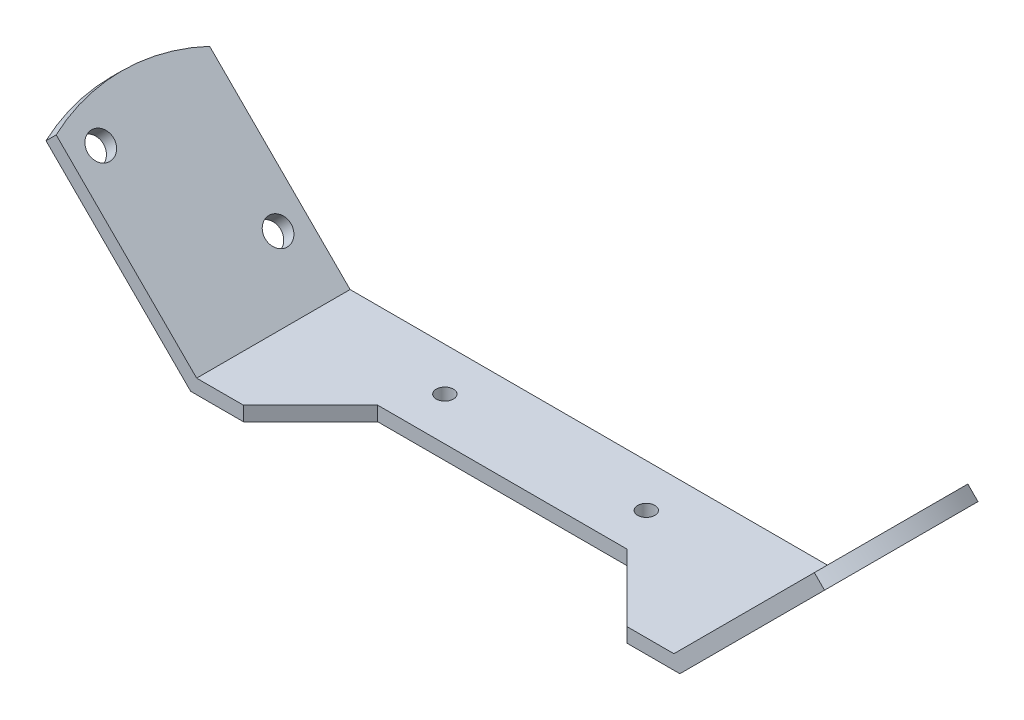
ISO-10303-21;
HEADER;
FILE_DESCRIPTION(('STEP AP214'),'2;1');
FILE_NAME('part.step','',(''),(''),'','','');
FILE_SCHEMA(('AUTOMOTIVE_DESIGN { 1 0 10303 214 1 1 1 1 }'));
ENDSEC;
DATA;
#1=APPLICATION_CONTEXT('core data for automotive mechanical design processes');
#2=APPLICATION_PROTOCOL_DEFINITION('international standard','automotive_design',2000,#1);
#3=PRODUCT_CONTEXT('',#1,'mechanical');
#4=PRODUCT('Part','Part','',(#3));
#5=PRODUCT_RELATED_PRODUCT_CATEGORY('part','',(#4));
#6=PRODUCT_DEFINITION_FORMATION('','',#4);
#7=PRODUCT_DEFINITION_CONTEXT('part definition',#1,'design');
#8=PRODUCT_DEFINITION('design','',#6,#7);
#9=PRODUCT_DEFINITION_SHAPE('','',#8);
#10=(LENGTH_UNIT() NAMED_UNIT(*) SI_UNIT(.MILLI.,.METRE.));
#11=(NAMED_UNIT(*) PLANE_ANGLE_UNIT() SI_UNIT($,.RADIAN.));
#12=(NAMED_UNIT(*) SI_UNIT($,.STERADIAN.) SOLID_ANGLE_UNIT());
#13=UNCERTAINTY_MEASURE_WITH_UNIT(LENGTH_MEASURE(1.E-05),#10,'distance_accuracy_value','');
#14=(GEOMETRIC_REPRESENTATION_CONTEXT(3) GLOBAL_UNCERTAINTY_ASSIGNED_CONTEXT((#13)) GLOBAL_UNIT_ASSIGNED_CONTEXT((#10,
#11,#12)) REPRESENTATION_CONTEXT('',''));
#15=CARTESIAN_POINT('',(0.,0.,0.));
#16=DIRECTION('',(0.,0.,1.));
#17=DIRECTION('',(1.,0.,0.));
#18=AXIS2_PLACEMENT_3D('',#15,#16,#17);
#19=CARTESIAN_POINT('',(0.,1.5,0.));
#20=DIRECTION('',(0.,1.,0.));
#21=DIRECTION('',(0.,0.,1.));
#22=AXIS2_PLACEMENT_3D('',#19,#20,#21);
#23=PLANE('',#22);
#24=CARTESIAN_POINT('',(-10.5,1.5,0.));
#25=DIRECTION('',(0.,1.,0.));
#26=DIRECTION('',(0.,0.,1.));
#27=AXIS2_PLACEMENT_3D('',#24,#25,#26);
#28=CIRCLE('',#27,0.9);
#29=CARTESIAN_POINT('',(-10.5,1.5,0.899999999999995));
#30=VERTEX_POINT('',#29);
#31=EDGE_CURVE('E274',#30,#30,#28,.T.);
#32=ORIENTED_EDGE('',*,*,#31,.F.);
#33=EDGE_LOOP('',(#32));
#34=FACE_BOUND('',#33,.T.);
#35=CARTESIAN_POINT('',(10.5,1.5,0.));
#36=DIRECTION('',(0.,1.,0.));
#37=DIRECTION('',(0.,0.,1.));
#38=AXIS2_PLACEMENT_3D('',#35,#36,#37);
#39=CIRCLE('',#38,0.9);
#40=CARTESIAN_POINT('',(10.5,1.5,0.899999999999995));
#41=VERTEX_POINT('',#40);
#42=EDGE_CURVE('E268',#41,#41,#39,.T.);
#43=ORIENTED_EDGE('',*,*,#42,.F.);
#44=EDGE_LOOP('',(#43));
#45=FACE_BOUND('',#44,.T.);
#46=DIRECTION('',(-1.,0.,0.));
#47=VECTOR('',#46,1.);
#48=CARTESIAN_POINT('',(0.,1.5,-4.5));
#49=LINE('',#48,#47);
#50=CARTESIAN_POINT('',(24.8786796564404,1.5,-4.5));
#51=VERTEX_POINT('',#50);
#52=CARTESIAN_POINT('',(-24.8786796564404,1.5,-4.5));
#53=VERTEX_POINT('',#52);
#54=EDGE_CURVE('E187',#51,#53,#49,.T.);
#55=ORIENTED_EDGE('',*,*,#54,.T.);
#56=DIRECTION('',(0.,0.,1.));
#57=VECTOR('',#56,1.);
#58=CARTESIAN_POINT('',(-24.8786796564404,1.5,0.));
#59=LINE('',#58,#57);
#60=CARTESIAN_POINT('',(-24.8786796564404,1.5,11.5));
#61=VERTEX_POINT('',#60);
#62=EDGE_CURVE('E150',#53,#61,#59,.T.);
#63=ORIENTED_EDGE('',*,*,#62,.T.);
#64=DIRECTION('',(-1.,0.,0.));
#65=VECTOR('',#64,1.);
#66=CARTESIAN_POINT('',(0.,1.5,11.5));
#67=LINE('',#66,#65);
#68=CARTESIAN_POINT('',(-19.9999999999999,1.5,11.5));
#69=VERTEX_POINT('',#68);
#70=EDGE_CURVE('E130',#69,#61,#67,.T.);
#71=ORIENTED_EDGE('',*,*,#70,.F.);
#72=DIRECTION('',(-0.707106781186544,0.,0.707106781186551));
#73=VECTOR('',#72,1.);
#74=CARTESIAN_POINT('',(-4.25000000000007,1.5,-4.25000000000002));
#75=LINE('',#74,#73);
#76=CARTESIAN_POINT('',(-13.,1.5,4.50000000000001));
#77=VERTEX_POINT('',#76);
#78=EDGE_CURVE('E178',#77,#69,#75,.T.);
#79=ORIENTED_EDGE('',*,*,#78,.F.);
#80=DIRECTION('',(1.,0.,0.));
#81=VECTOR('',#80,1.);
#82=CARTESIAN_POINT('',(0.,1.5,4.5));
#83=LINE('',#82,#81);
#84=CARTESIAN_POINT('',(13.,1.5,4.5));
#85=VERTEX_POINT('',#84);
#86=EDGE_CURVE('E182',#77,#85,#83,.T.);
#87=ORIENTED_EDGE('',*,*,#86,.T.);
#88=DIRECTION('',(0.707106781186544,0.,0.707106781186551));
#89=VECTOR('',#88,1.);
#90=CARTESIAN_POINT('',(4.25000000000006,1.5,-4.25000000000002));
#91=LINE('',#90,#89);
#92=CARTESIAN_POINT('',(19.9999999999999,1.5,11.5));
#93=VERTEX_POINT('',#92);
#94=EDGE_CURVE('E184',#85,#93,#91,.T.);
#95=ORIENTED_EDGE('',*,*,#94,.T.);
#96=DIRECTION('',(1.,0.,0.));
#97=VECTOR('',#96,1.);
#98=CARTESIAN_POINT('',(0.,1.5,11.5));
#99=LINE('',#98,#97);
#100=CARTESIAN_POINT('',(24.8786796564404,1.5,11.5));
#101=VERTEX_POINT('',#100);
#102=EDGE_CURVE('E57',#93,#101,#99,.T.);
#103=ORIENTED_EDGE('',*,*,#102,.T.);
#104=DIRECTION('',(0.,0.,-1.));
#105=VECTOR('',#104,1.);
#106=CARTESIAN_POINT('',(24.8786796564404,1.5,0.));
#107=LINE('',#106,#105);
#108=EDGE_CURVE('E11',#101,#51,#107,.T.);
#109=ORIENTED_EDGE('',*,*,#108,.T.);
#110=EDGE_LOOP('',(#55,#63,#71,#79,#87,#95,#103,#109));
#111=FACE_BOUND('',#110,.T.);
#112=ADVANCED_FACE('F38',(#34,#45,#111),#23,.T.);
#113=CARTESIAN_POINT('',(0.,1.5,11.5));
#114=DIRECTION('',(0.,0.,1.));
#115=DIRECTION('',(1.,0.,0.));
#116=AXIS2_PLACEMENT_3D('',#113,#114,#115);
#117=PLANE('',#116);
#118=ORIENTED_EDGE('',*,*,#70,.T.);
#119=DIRECTION('',(-0.707106781186551,0.707106781186544,0.));
#120=VECTOR('',#119,1.);
#121=CARTESIAN_POINT('',(-11.68933982822,-11.6893398282202,11.5));
#122=LINE('',#121,#120);
#123=CARTESIAN_POINT('',(-39.5221415685956,16.1434619121551,11.5));
#124=VERTEX_POINT('',#123);
#125=EDGE_CURVE('E124',#61,#124,#122,.T.);
#126=ORIENTED_EDGE('',*,*,#125,.T.);
#127=DIRECTION('',(-0.707106781186544,-0.707106781186551,0.));
#128=VECTOR('',#127,1.);
#129=CARTESIAN_POINT('',(-39.5221415685956,16.1434619121551,11.5));
#130=LINE('',#129,#128);
#131=CARTESIAN_POINT('',(-40.5828017403755,15.0828017403753,11.5));
#132=VERTEX_POINT('',#131);
#133=EDGE_CURVE('E127',#124,#132,#130,.T.);
#134=ORIENTED_EDGE('',*,*,#133,.T.);
#135=DIRECTION('',(-0.707106781186551,0.707106781186544,0.));
#136=VECTOR('',#135,1.);
#137=CARTESIAN_POINT('',(-12.7499999999999,-12.75,11.5));
#138=LINE('',#137,#136);
#139=CARTESIAN_POINT('',(-25.5,0.,11.5));
#140=VERTEX_POINT('',#139);
#141=EDGE_CURVE('E221',#140,#132,#138,.T.);
#142=ORIENTED_EDGE('',*,*,#141,.F.);
#143=DIRECTION('',(-1.,0.,0.));
#144=VECTOR('',#143,1.);
#145=CARTESIAN_POINT('',(0.,0.,11.5));
#146=LINE('',#145,#144);
#147=CARTESIAN_POINT('',(-19.9999999999999,0.,11.5));
#148=VERTEX_POINT('',#147);
#149=EDGE_CURVE('E192',#148,#140,#146,.T.);
#150=ORIENTED_EDGE('',*,*,#149,.F.);
#151=DIRECTION('',(0.,-1.,0.));
#152=VECTOR('',#151,1.);
#153=CARTESIAN_POINT('',(-19.9999999999999,1.5,11.5));
#154=LINE('',#153,#152);
#155=EDGE_CURVE('E47',#69,#148,#154,.T.);
#156=ORIENTED_EDGE('',*,*,#155,.F.);
#157=EDGE_LOOP('',(#118,#126,#134,#142,#150,#156));
#158=FACE_BOUND('',#157,.T.);
#159=ADVANCED_FACE('F40',(#158),#117,.T.);
#160=CARTESIAN_POINT('',(-4.25000000000007,1.5,-4.25000000000002));
#161=DIRECTION('',(0.707106781186551,0.,0.707106781186544));
#162=DIRECTION('',(0.707106781186544,0.,-0.707106781186551));
#163=AXIS2_PLACEMENT_3D('',#160,#161,#162);
#164=PLANE('',#163);
#165=DIRECTION('',(-0.707106781186544,0.,0.707106781186551));
#166=VECTOR('',#165,1.);
#167=CARTESIAN_POINT('',(-4.25000000000007,0.,-4.25000000000002));
#168=LINE('',#167,#166);
#169=CARTESIAN_POINT('',(-13.,0.,4.50000000000001));
#170=VERTEX_POINT('',#169);
#171=EDGE_CURVE('E195',#170,#148,#168,.T.);
#172=ORIENTED_EDGE('',*,*,#171,.F.);
#173=DIRECTION('',(0.,-1.,0.));
#174=VECTOR('',#173,1.);
#175=CARTESIAN_POINT('',(-13.,1.5,4.50000000000001));
#176=LINE('',#175,#174);
#177=EDGE_CURVE('E214',#77,#170,#176,.T.);
#178=ORIENTED_EDGE('',*,*,#177,.F.);
#179=ORIENTED_EDGE('',*,*,#78,.T.);
#180=ORIENTED_EDGE('',*,*,#155,.T.);
#181=EDGE_LOOP('',(#172,#178,#179,#180));
#182=FACE_BOUND('',#181,.T.);
#183=ADVANCED_FACE('F219',(#182),#164,.T.);
#184=CARTESIAN_POINT('',(0.,1.5,4.5));
#185=DIRECTION('',(0.,0.,-1.));
#186=DIRECTION('',(-1.,0.,0.));
#187=AXIS2_PLACEMENT_3D('',#184,#185,#186);
#188=PLANE('',#187);
#189=DIRECTION('',(1.,0.,0.));
#190=VECTOR('',#189,1.);
#191=CARTESIAN_POINT('',(0.,0.,4.5));
#192=LINE('',#191,#190);
#193=CARTESIAN_POINT('',(13.,0.,4.5));
#194=VERTEX_POINT('',#193);
#195=EDGE_CURVE('E198',#170,#194,#192,.T.);
#196=ORIENTED_EDGE('',*,*,#195,.T.);
#197=DIRECTION('',(0.,-1.,0.));
#198=VECTOR('',#197,1.);
#199=CARTESIAN_POINT('',(13.,1.5,4.5));
#200=LINE('',#199,#198);
#201=EDGE_CURVE('E211',#85,#194,#200,.T.);
#202=ORIENTED_EDGE('',*,*,#201,.F.);
#203=ORIENTED_EDGE('',*,*,#86,.F.);
#204=ORIENTED_EDGE('',*,*,#177,.T.);
#205=EDGE_LOOP('',(#196,#202,#203,#204));
#206=FACE_BOUND('',#205,.T.);
#207=ADVANCED_FACE('F230',(#206),#188,.F.);
#208=CARTESIAN_POINT('',(4.25000000000006,1.5,-4.25000000000002));
#209=DIRECTION('',(0.707106781186551,0.,-0.707106781186544));
#210=DIRECTION('',(-0.707106781186544,0.,-0.707106781186551));
#211=AXIS2_PLACEMENT_3D('',#208,#209,#210);
#212=PLANE('',#211);
#213=DIRECTION('',(0.707106781186544,0.,0.707106781186551));
#214=VECTOR('',#213,1.);
#215=CARTESIAN_POINT('',(4.25000000000006,0.,-4.25000000000002));
#216=LINE('',#215,#214);
#217=CARTESIAN_POINT('',(19.9999999999999,0.,11.5));
#218=VERTEX_POINT('',#217);
#219=EDGE_CURVE('E200',#194,#218,#216,.T.);
#220=ORIENTED_EDGE('',*,*,#219,.T.);
#221=DIRECTION('',(0.,-1.,0.));
#222=VECTOR('',#221,1.);
#223=CARTESIAN_POINT('',(19.9999999999999,1.5,11.5));
#224=LINE('',#223,#222);
#225=EDGE_CURVE('E189',#93,#218,#224,.T.);
#226=ORIENTED_EDGE('',*,*,#225,.F.);
#227=ORIENTED_EDGE('',*,*,#94,.F.);
#228=ORIENTED_EDGE('',*,*,#201,.T.);
#229=EDGE_LOOP('',(#220,#226,#227,#228));
#230=FACE_BOUND('',#229,.T.);
#231=ADVANCED_FACE('F234',(#230),#212,.F.);
#232=CARTESIAN_POINT('',(0.,1.5,11.5));
#233=DIRECTION('',(0.,0.,-1.));
#234=DIRECTION('',(-1.,0.,0.));
#235=AXIS2_PLACEMENT_3D('',#232,#233,#234);
#236=PLANE('',#235);
#237=DIRECTION('',(1.,0.,0.));
#238=VECTOR('',#237,1.);
#239=CARTESIAN_POINT('',(0.,0.,11.5));
#240=LINE('',#239,#238);
#241=CARTESIAN_POINT('',(25.5,0.,11.5));
#242=VERTEX_POINT('',#241);
#243=EDGE_CURVE('E202',#218,#242,#240,.T.);
#244=ORIENTED_EDGE('',*,*,#243,.T.);
#245=DIRECTION('',(0.707106781186551,0.707106781186544,0.));
#246=VECTOR('',#245,1.);
#247=CARTESIAN_POINT('',(12.7499999999999,-12.75,11.5));
#248=LINE('',#247,#246);
#249=CARTESIAN_POINT('',(40.5828017403754,15.0828017403753,11.5));
#250=VERTEX_POINT('',#249);
#251=EDGE_CURVE('E168',#242,#250,#248,.T.);
#252=ORIENTED_EDGE('',*,*,#251,.T.);
#253=DIRECTION('',(0.707106781186544,-0.707106781186551,0.));
#254=VECTOR('',#253,1.);
#255=CARTESIAN_POINT('',(39.5221415685956,16.1434619121551,11.5));
#256=LINE('',#255,#254);
#257=CARTESIAN_POINT('',(39.5221415685956,16.1434619121551,11.5));
#258=VERTEX_POINT('',#257);
#259=EDGE_CURVE('E165',#258,#250,#256,.T.);
#260=ORIENTED_EDGE('',*,*,#259,.F.);
#261=DIRECTION('',(0.707106781186551,0.707106781186544,0.));
#262=VECTOR('',#261,1.);
#263=CARTESIAN_POINT('',(11.6893398282201,-11.6893398282202,11.5));
#264=LINE('',#263,#262);
#265=EDGE_CURVE('E160',#101,#258,#264,.T.);
#266=ORIENTED_EDGE('',*,*,#265,.F.);
#267=ORIENTED_EDGE('',*,*,#102,.F.);
#268=ORIENTED_EDGE('',*,*,#225,.T.);
#269=EDGE_LOOP('',(#244,#252,#260,#266,#267,#268));
#270=FACE_BOUND('',#269,.T.);
#271=ADVANCED_FACE('F337',(#270),#236,.F.);
#272=CARTESIAN_POINT('',(0.,1.5,-4.5));
#273=DIRECTION('',(0.,0.,1.));
#274=DIRECTION('',(1.,0.,0.));
#275=AXIS2_PLACEMENT_3D('',#272,#273,#274);
#276=PLANE('',#275);
#277=DIRECTION('',(-0.707106781186551,0.707106781186544,0.));
#278=VECTOR('',#277,1.);
#279=CARTESIAN_POINT('',(-11.68933982822,-11.6893398282202,-4.5));
#280=LINE('',#279,#278);
#281=CARTESIAN_POINT('',(-39.5221415685956,16.1434619121551,-4.50000000000001));
#282=VERTEX_POINT('',#281);
#283=EDGE_CURVE('E139',#53,#282,#280,.T.);
#284=ORIENTED_EDGE('',*,*,#283,.F.);
#285=ORIENTED_EDGE('',*,*,#54,.F.);
#286=DIRECTION('',(0.707106781186551,0.707106781186544,0.));
#287=VECTOR('',#286,1.);
#288=CARTESIAN_POINT('',(11.68933982822,-11.6893398282202,-4.50000000000001));
#289=LINE('',#288,#287);
#290=CARTESIAN_POINT('',(39.5221415685956,16.1434619121551,-4.5));
#291=VERTEX_POINT('',#290);
#292=EDGE_CURVE('E163',#51,#291,#289,.T.);
#293=ORIENTED_EDGE('',*,*,#292,.T.);
#294=DIRECTION('',(0.707106781186544,-0.707106781186551,0.));
#295=VECTOR('',#294,1.);
#296=CARTESIAN_POINT('',(39.5221415685956,16.1434619121551,-4.5));
#297=LINE('',#296,#295);
#298=CARTESIAN_POINT('',(40.5828017403754,15.0828017403753,-4.5));
#299=VERTEX_POINT('',#298);
#300=EDGE_CURVE('E173',#291,#299,#297,.T.);
#301=ORIENTED_EDGE('',*,*,#300,.T.);
#302=DIRECTION('',(0.707106781186551,0.707106781186544,0.));
#303=VECTOR('',#302,1.);
#304=CARTESIAN_POINT('',(12.7499999999999,-12.75,-4.50000000000001));
#305=LINE('',#304,#303);
#306=CARTESIAN_POINT('',(25.5,0.,-4.50000000000001));
#307=VERTEX_POINT('',#306);
#308=EDGE_CURVE('E161',#307,#299,#305,.T.);
#309=ORIENTED_EDGE('',*,*,#308,.F.);
#310=DIRECTION('',(-1.,0.,0.));
#311=VECTOR('',#310,1.);
#312=CARTESIAN_POINT('',(0.,0.,-4.5));
#313=LINE('',#312,#311);
#314=CARTESIAN_POINT('',(-25.5,0.,-4.5));
#315=VERTEX_POINT('',#314);
#316=EDGE_CURVE('E179',#307,#315,#313,.T.);
#317=ORIENTED_EDGE('',*,*,#316,.T.);
#318=DIRECTION('',(-0.707106781186551,0.707106781186544,0.));
#319=VECTOR('',#318,1.);
#320=CARTESIAN_POINT('',(-12.7499999999999,-12.75,-4.5));
#321=LINE('',#320,#319);
#322=CARTESIAN_POINT('',(-40.5828017403754,15.0828017403753,-4.50000000000001));
#323=VERTEX_POINT('',#322);
#324=EDGE_CURVE('E134',#315,#323,#321,.T.);
#325=ORIENTED_EDGE('',*,*,#324,.T.);
#326=DIRECTION('',(-0.707106781186544,-0.707106781186551,0.));
#327=VECTOR('',#326,1.);
#328=CARTESIAN_POINT('',(-39.5221415685956,16.1434619121551,-4.50000000000001));
#329=LINE('',#328,#327);
#330=EDGE_CURVE('E148',#282,#323,#329,.T.);
#331=ORIENTED_EDGE('',*,*,#330,.F.);
#332=EDGE_LOOP('',(#284,#285,#293,#301,#309,#317,#325,#331));
#333=FACE_BOUND('',#332,.T.);
#334=ADVANCED_FACE('F237',(#333),#276,.F.);
#335=CARTESIAN_POINT('',(0.,0.,0.));
#336=DIRECTION('',(0.,1.,0.));
#337=DIRECTION('',(0.,0.,1.));
#338=AXIS2_PLACEMENT_3D('',#335,#336,#337);
#339=PLANE('',#338);
#340=CARTESIAN_POINT('',(-10.5,0.,0.));
#341=DIRECTION('',(0.,1.,0.));
#342=DIRECTION('',(0.,0.,1.));
#343=AXIS2_PLACEMENT_3D('',#340,#341,#342);
#344=CIRCLE('',#343,0.9);
#345=CARTESIAN_POINT('',(-10.5,0.,0.899999999999995));
#346=VERTEX_POINT('',#345);
#347=EDGE_CURVE('E271',#346,#346,#344,.T.);
#348=ORIENTED_EDGE('',*,*,#347,.T.);
#349=EDGE_LOOP('',(#348));
#350=FACE_BOUND('',#349,.T.);
#351=CARTESIAN_POINT('',(10.5,0.,0.));
#352=DIRECTION('',(0.,1.,0.));
#353=DIRECTION('',(0.,0.,1.));
#354=AXIS2_PLACEMENT_3D('',#351,#352,#353);
#355=CIRCLE('',#354,0.9);
#356=CARTESIAN_POINT('',(10.5,0.,0.899999999999995));
#357=VERTEX_POINT('',#356);
#358=EDGE_CURVE('E265',#357,#357,#355,.T.);
#359=ORIENTED_EDGE('',*,*,#358,.T.);
#360=EDGE_LOOP('',(#359));
#361=FACE_BOUND('',#360,.T.);
#362=DIRECTION('',(0.,0.,-1.));
#363=VECTOR('',#362,1.);
#364=CARTESIAN_POINT('',(-25.5,0.,0.));
#365=LINE('',#364,#363);
#366=EDGE_CURVE('E175',#140,#315,#365,.T.);
#367=ORIENTED_EDGE('',*,*,#366,.T.);
#368=ORIENTED_EDGE('',*,*,#316,.F.);
#369=DIRECTION('',(0.,0.,-1.));
#370=VECTOR('',#369,1.);
#371=CARTESIAN_POINT('',(25.5,0.,0.));
#372=LINE('',#371,#370);
#373=EDGE_CURVE('E204',#242,#307,#372,.T.);
#374=ORIENTED_EDGE('',*,*,#373,.F.);
#375=ORIENTED_EDGE('',*,*,#243,.F.);
#376=ORIENTED_EDGE('',*,*,#219,.F.);
#377=ORIENTED_EDGE('',*,*,#195,.F.);
#378=ORIENTED_EDGE('',*,*,#171,.T.);
#379=ORIENTED_EDGE('',*,*,#149,.T.);
#380=EDGE_LOOP('',(#367,#368,#374,#375,#376,#377,#378,#379));
#381=FACE_BOUND('',#380,.T.);
#382=ADVANCED_FACE('F225',(#350,#361,#381),#339,.F.);
#383=CARTESIAN_POINT('',(26.5606601717798,3.18198051533946,3.49999999999999));
#384=DIRECTION('',(0.707106781186544,-0.707106781186551,0.));
#385=DIRECTION('',(0.707106781186551,0.707106781186544,0.));
#386=AXIS2_PLACEMENT_3D('',#383,#384,#385);
#387=CYLINDRICAL_SURFACE('',#386,20.);
#388=CARTESIAN_POINT('',(27.6213203435596,2.12132034355963,3.49999999999999));
#389=DIRECTION('',(0.707106781186544,-0.707106781186551,0.));
#390=DIRECTION('',(0.707106781186551,0.707106781186544,0.));
#391=AXIS2_PLACEMENT_3D('',#388,#389,#390);
#392=CIRCLE('',#391,20.);
#393=EDGE_CURVE('E156',#299,#250,#392,.T.);
#394=ORIENTED_EDGE('',*,*,#393,.F.);
#395=ORIENTED_EDGE('',*,*,#300,.F.);
#396=CARTESIAN_POINT('',(26.5606601717798,3.18198051533946,3.49999999999999));
#397=DIRECTION('',(0.707106781186544,-0.707106781186551,0.));
#398=DIRECTION('',(0.707106781186551,0.707106781186544,0.));
#399=AXIS2_PLACEMENT_3D('',#396,#397,#398);
#400=CIRCLE('',#399,20.);
#401=EDGE_CURVE('E157',#291,#258,#400,.T.);
#402=ORIENTED_EDGE('',*,*,#401,.T.);
#403=ORIENTED_EDGE('',*,*,#259,.T.);
#404=EDGE_LOOP('',(#394,#395,#402,#403));
#405=FACE_BOUND('',#404,.T.);
#406=ADVANCED_FACE('F324',(#405),#387,.T.);
#407=CARTESIAN_POINT('',(11.68933982822,-11.6893398282202,0.));
#408=DIRECTION('',(0.707106781186544,-0.707106781186551,0.));
#409=DIRECTION('',(0.707106781186551,0.707106781186544,0.));
#410=AXIS2_PLACEMENT_3D('',#407,#408,#409);
#411=PLANE('',#410);
#412=CARTESIAN_POINT('',(29.389087296526,6.01040764008563,-1.50000000000001));
#413=DIRECTION('',(-0.707106781186544,0.707106781186551,0.));
#414=DIRECTION('',(-0.707106781186551,-0.707106781186544,0.));
#415=AXIS2_PLACEMENT_3D('',#412,#413,#414);
#416=CIRCLE('',#415,1.34999999999999);
#417=CARTESIAN_POINT('',(28.4344931419242,5.0558134854838,-1.50000000000001));
#418=VERTEX_POINT('',#417);
#419=EDGE_CURVE('E262',#418,#418,#416,.T.);
#420=ORIENTED_EDGE('',*,*,#419,.F.);
#421=EDGE_LOOP('',(#420));
#422=FACE_BOUND('',#421,.T.);
#423=CARTESIAN_POINT('',(37.8743686707647,14.4956890143241,8.49999999999999));
#424=DIRECTION('',(-0.707106781186544,0.707106781186551,0.));
#425=DIRECTION('',(-0.707106781186551,-0.707106781186544,0.));
#426=AXIS2_PLACEMENT_3D('',#423,#424,#425);
#427=CIRCLE('',#426,1.34999999999999);
#428=CARTESIAN_POINT('',(36.9197745161628,13.5410948597223,8.49999999999999));
#429=VERTEX_POINT('',#428);
#430=EDGE_CURVE('E259',#429,#429,#427,.T.);
#431=ORIENTED_EDGE('',*,*,#430,.F.);
#432=EDGE_LOOP('',(#431));
#433=FACE_BOUND('',#432,.T.);
#434=ORIENTED_EDGE('',*,*,#108,.F.);
#435=ORIENTED_EDGE('',*,*,#265,.T.);
#436=ORIENTED_EDGE('',*,*,#401,.F.);
#437=ORIENTED_EDGE('',*,*,#292,.F.);
#438=EDGE_LOOP('',(#434,#435,#436,#437));
#439=FACE_BOUND('',#438,.T.);
#440=ADVANCED_FACE('F321',(#422,#433,#439),#411,.F.);
#441=CARTESIAN_POINT('',(12.7499999999999,-12.75,0.));
#442=DIRECTION('',(0.707106781186544,-0.707106781186551,0.));
#443=DIRECTION('',(0.707106781186551,0.707106781186544,0.));
#444=AXIS2_PLACEMENT_3D('',#441,#442,#443);
#445=PLANE('',#444);
#446=CARTESIAN_POINT('',(30.4497474683059,4.9497474683058,-1.50000000000001));
#447=DIRECTION('',(0.707106781186544,-0.707106781186551,0.));
#448=DIRECTION('',(0.707106781186551,0.707106781186544,0.));
#449=AXIS2_PLACEMENT_3D('',#446,#447,#448);
#450=CIRCLE('',#449,1.34999999999999);
#451=CARTESIAN_POINT('',(31.4043416229077,5.90434162290763,-1.50000000000001));
#452=VERTEX_POINT('',#451);
#453=EDGE_CURVE('E42',#452,#452,#450,.T.);
#454=ORIENTED_EDGE('',*,*,#453,.F.);
#455=EDGE_LOOP('',(#454));
#456=FACE_BOUND('',#455,.T.);
#457=CARTESIAN_POINT('',(38.9350288425445,13.4350288425443,8.49999999999999));
#458=DIRECTION('',(0.707106781186544,-0.707106781186551,0.));
#459=DIRECTION('',(0.707106781186551,0.707106781186544,0.));
#460=AXIS2_PLACEMENT_3D('',#457,#458,#459);
#461=CIRCLE('',#460,1.34999999999999);
#462=CARTESIAN_POINT('',(39.8896229971463,14.3896229971461,8.49999999999999));
#463=VERTEX_POINT('',#462);
#464=EDGE_CURVE('E256',#463,#463,#461,.T.);
#465=ORIENTED_EDGE('',*,*,#464,.F.);
#466=EDGE_LOOP('',(#465));
#467=FACE_BOUND('',#466,.T.);
#468=ORIENTED_EDGE('',*,*,#393,.T.);
#469=ORIENTED_EDGE('',*,*,#251,.F.);
#470=ORIENTED_EDGE('',*,*,#373,.T.);
#471=ORIENTED_EDGE('',*,*,#308,.T.);
#472=EDGE_LOOP('',(#468,#469,#470,#471));
#473=FACE_BOUND('',#472,.T.);
#474=ADVANCED_FACE('F320',(#456,#467,#473),#445,.T.);
#475=CARTESIAN_POINT('',(-26.5606601717798,3.18198051533946,3.49999999999999));
#476=DIRECTION('',(-0.707106781186544,-0.707106781186551,0.));
#477=DIRECTION('',(0.707106781186551,-0.707106781186544,0.));
#478=AXIS2_PLACEMENT_3D('',#475,#476,#477);
#479=CYLINDRICAL_SURFACE('',#478,20.);
#480=CARTESIAN_POINT('',(-27.6213203435596,2.12132034355963,3.49999999999999));
#481=DIRECTION('',(-0.707106781186544,-0.707106781186551,0.));
#482=DIRECTION('',(0.707106781186551,-0.707106781186544,0.));
#483=AXIS2_PLACEMENT_3D('',#480,#481,#482);
#484=CIRCLE('',#483,20.);
#485=EDGE_CURVE('E146',#323,#132,#484,.F.);
#486=ORIENTED_EDGE('',*,*,#485,.T.);
#487=ORIENTED_EDGE('',*,*,#133,.F.);
#488=CARTESIAN_POINT('',(-26.5606601717798,3.18198051533946,3.49999999999999));
#489=DIRECTION('',(-0.707106781186544,-0.707106781186551,0.));
#490=DIRECTION('',(0.707106781186551,-0.707106781186544,0.));
#491=AXIS2_PLACEMENT_3D('',#488,#489,#490);
#492=CIRCLE('',#491,20.);
#493=EDGE_CURVE('E133',#282,#124,#492,.F.);
#494=ORIENTED_EDGE('',*,*,#493,.F.);
#495=ORIENTED_EDGE('',*,*,#330,.T.);
#496=EDGE_LOOP('',(#486,#487,#494,#495));
#497=FACE_BOUND('',#496,.T.);
#498=ADVANCED_FACE('F144',(#497),#479,.T.);
#499=CARTESIAN_POINT('',(-11.68933982822,-11.6893398282202,0.));
#500=DIRECTION('',(-0.707106781186544,-0.707106781186551,0.));
#501=DIRECTION('',(0.707106781186551,-0.707106781186544,0.));
#502=AXIS2_PLACEMENT_3D('',#499,#500,#501);
#503=PLANE('',#502);
#504=CARTESIAN_POINT('',(-37.8743686707647,14.4956890143242,8.49999999999999));
#505=DIRECTION('',(0.707106781186544,0.707106781186551,0.));
#506=DIRECTION('',(-0.707106781186551,0.707106781186544,0.));
#507=AXIS2_PLACEMENT_3D('',#504,#505,#506);
#508=CIRCLE('',#507,1.34999999999999);
#509=CARTESIAN_POINT('',(-38.8289628253665,15.450283168926,8.49999999999999));
#510=VERTEX_POINT('',#509);
#511=EDGE_CURVE('E253',#510,#510,#508,.T.);
#512=ORIENTED_EDGE('',*,*,#511,.F.);
#513=EDGE_LOOP('',(#512));
#514=FACE_BOUND('',#513,.T.);
#515=CARTESIAN_POINT('',(-29.389087296526,6.01040764008564,-1.50000000000001));
#516=DIRECTION('',(0.707106781186544,0.707106781186551,0.));
#517=DIRECTION('',(-0.707106781186551,0.707106781186544,0.));
#518=AXIS2_PLACEMENT_3D('',#515,#516,#517);
#519=CIRCLE('',#518,1.34999999999999);
#520=CARTESIAN_POINT('',(-30.3436814511279,6.96500179468746,-1.50000000000001));
#521=VERTEX_POINT('',#520);
#522=EDGE_CURVE('E247',#521,#521,#519,.T.);
#523=ORIENTED_EDGE('',*,*,#522,.F.);
#524=EDGE_LOOP('',(#523));
#525=FACE_BOUND('',#524,.T.);
#526=ORIENTED_EDGE('',*,*,#62,.F.);
#527=ORIENTED_EDGE('',*,*,#283,.T.);
#528=ORIENTED_EDGE('',*,*,#493,.T.);
#529=ORIENTED_EDGE('',*,*,#125,.F.);
#530=EDGE_LOOP('',(#526,#527,#528,#529));
#531=FACE_BOUND('',#530,.T.);
#532=ADVANCED_FACE('F137',(#514,#525,#531),#503,.F.);
#533=CARTESIAN_POINT('',(-12.7499999999999,-12.75,0.));
#534=DIRECTION('',(-0.707106781186544,-0.707106781186551,0.));
#535=DIRECTION('',(0.707106781186551,-0.707106781186544,0.));
#536=AXIS2_PLACEMENT_3D('',#533,#534,#535);
#537=PLANE('',#536);
#538=CARTESIAN_POINT('',(-38.9350288425445,13.4350288425443,8.49999999999999));
#539=DIRECTION('',(-0.707106781186544,-0.707106781186551,0.));
#540=DIRECTION('',(0.707106781186551,-0.707106781186544,0.));
#541=AXIS2_PLACEMENT_3D('',#538,#539,#540);
#542=CIRCLE('',#541,1.34999999999999);
#543=CARTESIAN_POINT('',(-37.9804346879426,12.4804346879425,8.49999999999999));
#544=VERTEX_POINT('',#543);
#545=EDGE_CURVE('E250',#544,#544,#542,.T.);
#546=ORIENTED_EDGE('',*,*,#545,.F.);
#547=EDGE_LOOP('',(#546));
#548=FACE_BOUND('',#547,.T.);
#549=CARTESIAN_POINT('',(-30.4497474683059,4.9497474683058,-1.50000000000001));
#550=DIRECTION('',(-0.707106781186544,-0.707106781186551,0.));
#551=DIRECTION('',(0.707106781186551,-0.707106781186544,0.));
#552=AXIS2_PLACEMENT_3D('',#549,#550,#551);
#553=CIRCLE('',#552,1.34999999999999);
#554=CARTESIAN_POINT('',(-29.495153313704,3.99515331370397,-1.50000000000001));
#555=VERTEX_POINT('',#554);
#556=EDGE_CURVE('E242',#555,#555,#553,.T.);
#557=ORIENTED_EDGE('',*,*,#556,.F.);
#558=EDGE_LOOP('',(#557));
#559=FACE_BOUND('',#558,.T.);
#560=ORIENTED_EDGE('',*,*,#366,.F.);
#561=ORIENTED_EDGE('',*,*,#141,.T.);
#562=ORIENTED_EDGE('',*,*,#485,.F.);
#563=ORIENTED_EDGE('',*,*,#324,.F.);
#564=EDGE_LOOP('',(#560,#561,#562,#563));
#565=FACE_BOUND('',#564,.T.);
#566=ADVANCED_FACE('F240',(#548,#559,#565),#537,.T.);
#567=CARTESIAN_POINT('',(-29.389087296526,6.01040764008564,-1.50000000000001));
#568=DIRECTION('',(0.707106781186544,0.707106781186551,0.));
#569=DIRECTION('',(-0.707106781186551,0.707106781186544,0.));
#570=AXIS2_PLACEMENT_3D('',#567,#568,#569);
#571=CYLINDRICAL_SURFACE('',#570,1.34999999999999);
#572=ORIENTED_EDGE('',*,*,#556,.T.);
#573=EDGE_LOOP('',(#572));
#574=FACE_BOUND('',#573,.T.);
#575=ORIENTED_EDGE('',*,*,#522,.T.);
#576=EDGE_LOOP('',(#575));
#577=FACE_BOUND('',#576,.T.);
#578=ADVANCED_FACE('F307',(#574,#577),#571,.F.);
#579=CARTESIAN_POINT('',(-37.8743686707647,14.4956890143242,8.49999999999999));
#580=DIRECTION('',(0.707106781186544,0.707106781186551,0.));
#581=DIRECTION('',(-0.707106781186551,0.707106781186544,0.));
#582=AXIS2_PLACEMENT_3D('',#579,#580,#581);
#583=CYLINDRICAL_SURFACE('',#582,1.34999999999999);
#584=ORIENTED_EDGE('',*,*,#545,.T.);
#585=EDGE_LOOP('',(#584));
#586=FACE_BOUND('',#585,.T.);
#587=ORIENTED_EDGE('',*,*,#511,.T.);
#588=EDGE_LOOP('',(#587));
#589=FACE_BOUND('',#588,.T.);
#590=ADVANCED_FACE('F303',(#586,#589),#583,.F.);
#591=CARTESIAN_POINT('',(37.8743686707647,14.4956890143241,8.49999999999999));
#592=DIRECTION('',(-0.707106781186544,0.707106781186551,0.));
#593=DIRECTION('',(-0.707106781186551,-0.707106781186544,0.));
#594=AXIS2_PLACEMENT_3D('',#591,#592,#593);
#595=CYLINDRICAL_SURFACE('',#594,1.34999999999999);
#596=ORIENTED_EDGE('',*,*,#464,.T.);
#597=EDGE_LOOP('',(#596));
#598=FACE_BOUND('',#597,.T.);
#599=ORIENTED_EDGE('',*,*,#430,.T.);
#600=EDGE_LOOP('',(#599));
#601=FACE_BOUND('',#600,.T.);
#602=ADVANCED_FACE('F296',(#598,#601),#595,.F.);
#603=CARTESIAN_POINT('',(29.389087296526,6.01040764008563,-1.50000000000001));
#604=DIRECTION('',(-0.707106781186544,0.707106781186551,0.));
#605=DIRECTION('',(-0.707106781186551,-0.707106781186544,0.));
#606=AXIS2_PLACEMENT_3D('',#603,#604,#605);
#607=CYLINDRICAL_SURFACE('',#606,1.34999999999999);
#608=ORIENTED_EDGE('',*,*,#453,.T.);
#609=EDGE_LOOP('',(#608));
#610=FACE_BOUND('',#609,.T.);
#611=ORIENTED_EDGE('',*,*,#419,.T.);
#612=EDGE_LOOP('',(#611));
#613=FACE_BOUND('',#612,.T.);
#614=ADVANCED_FACE('F287',(#610,#613),#607,.F.);
#615=CARTESIAN_POINT('',(10.5,1.5,0.));
#616=DIRECTION('',(0.,1.,0.));
#617=DIRECTION('',(0.,0.,1.));
#618=AXIS2_PLACEMENT_3D('',#615,#616,#617);
#619=CYLINDRICAL_SURFACE('',#618,0.9);
#620=ORIENTED_EDGE('',*,*,#358,.F.);
#621=EDGE_LOOP('',(#620));
#622=FACE_BOUND('',#621,.T.);
#623=ORIENTED_EDGE('',*,*,#42,.T.);
#624=EDGE_LOOP('',(#623));
#625=FACE_BOUND('',#624,.T.);
#626=ADVANCED_FACE('F285',(#622,#625),#619,.F.);
#627=CARTESIAN_POINT('',(-10.5,1.5,0.));
#628=DIRECTION('',(0.,1.,0.));
#629=DIRECTION('',(0.,0.,1.));
#630=AXIS2_PLACEMENT_3D('',#627,#628,#629);
#631=CYLINDRICAL_SURFACE('',#630,0.9);
#632=ORIENTED_EDGE('',*,*,#347,.F.);
#633=EDGE_LOOP('',(#632));
#634=FACE_BOUND('',#633,.T.);
#635=ORIENTED_EDGE('',*,*,#31,.T.);
#636=EDGE_LOOP('',(#635));
#637=FACE_BOUND('',#636,.T.);
#638=ADVANCED_FACE('F278',(#634,#637),#631,.F.);
#639=CLOSED_SHELL('',(#112,#159,#183,#207,#231,#271,#334,#382,#406,#440,#474,#498,#532,#566,
#578,#590,#602,#614,#626,#638));
#640=MANIFOLD_SOLID_BREP('B2',#639);
#641=ADVANCED_BREP_SHAPE_REPRESENTATION('',(#18,#640),#14);
#642=SHAPE_DEFINITION_REPRESENTATION(#9,#641);
ENDSEC;
END-ISO-10303-21;
